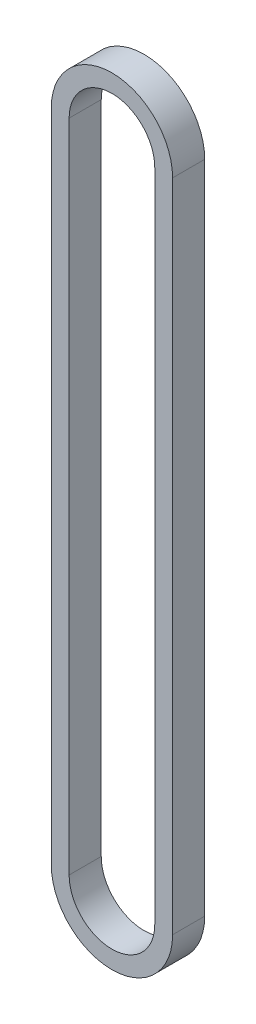
ISO-10303-21;
HEADER;
FILE_DESCRIPTION(('STEP AP214'),'2;1');
FILE_NAME('part.step','',(''),(''),'','','');
FILE_SCHEMA(('AUTOMOTIVE_DESIGN { 1 0 10303 214 1 1 1 1 }'));
ENDSEC;
DATA;
#1=APPLICATION_CONTEXT('core data for automotive mechanical design processes');
#2=APPLICATION_PROTOCOL_DEFINITION('international standard','automotive_design',2000,#1);
#3=PRODUCT_CONTEXT('',#1,'mechanical');
#4=PRODUCT('Part','Part','',(#3));
#5=PRODUCT_RELATED_PRODUCT_CATEGORY('part','',(#4));
#6=PRODUCT_DEFINITION_FORMATION('','',#4);
#7=PRODUCT_DEFINITION_CONTEXT('part definition',#1,'design');
#8=PRODUCT_DEFINITION('design','',#6,#7);
#9=PRODUCT_DEFINITION_SHAPE('','',#8);
#10=(LENGTH_UNIT() NAMED_UNIT(*) SI_UNIT(.MILLI.,.METRE.));
#11=(NAMED_UNIT(*) PLANE_ANGLE_UNIT() SI_UNIT($,.RADIAN.));
#12=(NAMED_UNIT(*) SI_UNIT($,.STERADIAN.) SOLID_ANGLE_UNIT());
#13=UNCERTAINTY_MEASURE_WITH_UNIT(LENGTH_MEASURE(1.E-05),#10,'distance_accuracy_value','');
#14=(GEOMETRIC_REPRESENTATION_CONTEXT(3) GLOBAL_UNCERTAINTY_ASSIGNED_CONTEXT((#13)) GLOBAL_UNIT_ASSIGNED_CONTEXT((#10,
#11,#12)) REPRESENTATION_CONTEXT('',''));
#15=CARTESIAN_POINT('',(0.,0.,0.));
#16=DIRECTION('',(0.,0.,1.));
#17=DIRECTION('',(1.,0.,0.));
#18=AXIS2_PLACEMENT_3D('',#15,#16,#17);
#19=CARTESIAN_POINT('',(0.,-45.925,4.5));
#20=DIRECTION('',(0.,0.,1.));
#21=DIRECTION('',(1.,0.,0.));
#22=AXIS2_PLACEMENT_3D('',#19,#20,#21);
#23=PLANE('',#22);
#24=CARTESIAN_POINT('',(0.,-45.925,4.5));
#25=DIRECTION('',(0.,0.,1.));
#26=DIRECTION('',(1.,0.,0.));
#27=AXIS2_PLACEMENT_3D('',#24,#25,#26);
#28=CIRCLE('',#27,8.5);
#29=CARTESIAN_POINT('',(-8.49999999999999,-45.925,4.5));
#30=VERTEX_POINT('',#29);
#31=CARTESIAN_POINT('',(8.50000000000001,-45.925,4.5));
#32=VERTEX_POINT('',#31);
#33=EDGE_CURVE('E136',#30,#32,#28,.T.);
#34=ORIENTED_EDGE('',*,*,#33,.T.);
#35=DIRECTION('',(0.,1.,0.));
#36=VECTOR('',#35,1.);
#37=CARTESIAN_POINT('',(8.50000000000001,-45.925,4.5));
#38=LINE('',#37,#36);
#39=CARTESIAN_POINT('',(8.49999999999999,45.925,4.5));
#40=VERTEX_POINT('',#39);
#41=EDGE_CURVE('E139',#32,#40,#38,.T.);
#42=ORIENTED_EDGE('',*,*,#41,.T.);
#43=CARTESIAN_POINT('',(0.,45.925,4.5));
#44=DIRECTION('',(0.,0.,1.));
#45=DIRECTION('',(1.,0.,0.));
#46=AXIS2_PLACEMENT_3D('',#43,#44,#45);
#47=CIRCLE('',#46,8.5);
#48=CARTESIAN_POINT('',(-8.5,45.925,4.5));
#49=VERTEX_POINT('',#48);
#50=EDGE_CURVE('E142',#40,#49,#47,.T.);
#51=ORIENTED_EDGE('',*,*,#50,.T.);
#52=DIRECTION('',(0.,-1.,0.));
#53=VECTOR('',#52,1.);
#54=CARTESIAN_POINT('',(-8.49999999999999,-45.925,4.5));
#55=LINE('',#54,#53);
#56=EDGE_CURVE('E144',#49,#30,#55,.T.);
#57=ORIENTED_EDGE('',*,*,#56,.T.);
#58=EDGE_LOOP('',(#34,#42,#51,#57));
#59=FACE_BOUND('',#58,.T.);
#60=DIRECTION('',(0.,1.,0.));
#61=VECTOR('',#60,1.);
#62=CARTESIAN_POINT('',(6.,-45.925,4.5));
#63=LINE('',#62,#61);
#64=CARTESIAN_POINT('',(6.,-45.925,4.5));
#65=VERTEX_POINT('',#64);
#66=CARTESIAN_POINT('',(5.99999999999999,45.925,4.5));
#67=VERTEX_POINT('',#66);
#68=EDGE_CURVE('E108',#65,#67,#63,.T.);
#69=ORIENTED_EDGE('',*,*,#68,.F.);
#70=CARTESIAN_POINT('',(0.,-45.925,4.5));
#71=DIRECTION('',(0.,0.,1.));
#72=DIRECTION('',(1.,0.,0.));
#73=AXIS2_PLACEMENT_3D('',#70,#71,#72);
#74=CIRCLE('',#73,6.);
#75=CARTESIAN_POINT('',(-6.,-45.925,4.5));
#76=VERTEX_POINT('',#75);
#77=EDGE_CURVE('E100',#76,#65,#74,.T.);
#78=ORIENTED_EDGE('',*,*,#77,.F.);
#79=DIRECTION('',(0.,-1.,0.));
#80=VECTOR('',#79,1.);
#81=CARTESIAN_POINT('',(-6.,-45.925,4.5));
#82=LINE('',#81,#80);
#83=CARTESIAN_POINT('',(-6.,45.925,4.5));
#84=VERTEX_POINT('',#83);
#85=EDGE_CURVE('E122',#84,#76,#82,.T.);
#86=ORIENTED_EDGE('',*,*,#85,.F.);
#87=CARTESIAN_POINT('',(0.,45.925,4.5));
#88=DIRECTION('',(0.,0.,1.));
#89=DIRECTION('',(1.,0.,0.));
#90=AXIS2_PLACEMENT_3D('',#87,#88,#89);
#91=CIRCLE('',#90,6.);
#92=EDGE_CURVE('E120',#67,#84,#91,.T.);
#93=ORIENTED_EDGE('',*,*,#92,.F.);
#94=EDGE_LOOP('',(#69,#78,#86,#93));
#95=FACE_BOUND('',#94,.T.);
#96=ADVANCED_FACE('F35',(#59,#95),#23,.T.);
#97=CARTESIAN_POINT('',(0.,-45.925,0.));
#98=DIRECTION('',(0.,0.,1.));
#99=DIRECTION('',(1.,0.,0.));
#100=AXIS2_PLACEMENT_3D('',#97,#98,#99);
#101=PLANE('',#100);
#102=CARTESIAN_POINT('',(0.,-45.925,0.));
#103=DIRECTION('',(0.,0.,1.));
#104=DIRECTION('',(1.,0.,0.));
#105=AXIS2_PLACEMENT_3D('',#102,#103,#104);
#106=CIRCLE('',#105,8.5);
#107=CARTESIAN_POINT('',(-8.49999999999999,-45.925,0.));
#108=VERTEX_POINT('',#107);
#109=CARTESIAN_POINT('',(8.50000000000001,-45.925,0.));
#110=VERTEX_POINT('',#109);
#111=EDGE_CURVE('E116',#108,#110,#106,.T.);
#112=ORIENTED_EDGE('',*,*,#111,.F.);
#113=DIRECTION('',(0.,-1.,0.));
#114=VECTOR('',#113,1.);
#115=CARTESIAN_POINT('',(-8.49999999999999,-45.925,0.));
#116=LINE('',#115,#114);
#117=CARTESIAN_POINT('',(-8.5,45.925,0.));
#118=VERTEX_POINT('',#117);
#119=EDGE_CURVE('E140',#118,#108,#116,.T.);
#120=ORIENTED_EDGE('',*,*,#119,.F.);
#121=CARTESIAN_POINT('',(0.,45.925,0.));
#122=DIRECTION('',(0.,0.,1.));
#123=DIRECTION('',(1.,0.,0.));
#124=AXIS2_PLACEMENT_3D('',#121,#122,#123);
#125=CIRCLE('',#124,8.5);
#126=CARTESIAN_POINT('',(8.49999999999999,45.925,0.));
#127=VERTEX_POINT('',#126);
#128=EDGE_CURVE('E151',#127,#118,#125,.T.);
#129=ORIENTED_EDGE('',*,*,#128,.F.);
#130=DIRECTION('',(0.,1.,0.));
#131=VECTOR('',#130,1.);
#132=CARTESIAN_POINT('',(8.50000000000001,-45.925,0.));
#133=LINE('',#132,#131);
#134=EDGE_CURVE('E149',#110,#127,#133,.T.);
#135=ORIENTED_EDGE('',*,*,#134,.F.);
#136=EDGE_LOOP('',(#112,#120,#129,#135));
#137=FACE_BOUND('',#136,.T.);
#138=CARTESIAN_POINT('',(0.,-45.925,0.));
#139=DIRECTION('',(0.,0.,1.));
#140=DIRECTION('',(1.,0.,0.));
#141=AXIS2_PLACEMENT_3D('',#138,#139,#140);
#142=CIRCLE('',#141,6.);
#143=CARTESIAN_POINT('',(-6.,-45.925,0.));
#144=VERTEX_POINT('',#143);
#145=CARTESIAN_POINT('',(6.,-45.925,0.));
#146=VERTEX_POINT('',#145);
#147=EDGE_CURVE('E58',#144,#146,#142,.T.);
#148=ORIENTED_EDGE('',*,*,#147,.T.);
#149=DIRECTION('',(0.,1.,0.));
#150=VECTOR('',#149,1.);
#151=CARTESIAN_POINT('',(6.,-45.925,0.));
#152=LINE('',#151,#150);
#153=CARTESIAN_POINT('',(5.99999999999999,45.925,0.));
#154=VERTEX_POINT('',#153);
#155=EDGE_CURVE('E115',#146,#154,#152,.T.);
#156=ORIENTED_EDGE('',*,*,#155,.T.);
#157=CARTESIAN_POINT('',(0.,45.925,0.));
#158=DIRECTION('',(0.,0.,1.));
#159=DIRECTION('',(1.,0.,0.));
#160=AXIS2_PLACEMENT_3D('',#157,#158,#159);
#161=CIRCLE('',#160,6.);
#162=CARTESIAN_POINT('',(-6.,45.925,0.));
#163=VERTEX_POINT('',#162);
#164=EDGE_CURVE('E128',#154,#163,#161,.T.);
#165=ORIENTED_EDGE('',*,*,#164,.T.);
#166=DIRECTION('',(0.,-1.,0.));
#167=VECTOR('',#166,1.);
#168=CARTESIAN_POINT('',(-6.,-45.925,0.));
#169=LINE('',#168,#167);
#170=EDGE_CURVE('E109',#163,#144,#169,.T.);
#171=ORIENTED_EDGE('',*,*,#170,.T.);
#172=EDGE_LOOP('',(#148,#156,#165,#171));
#173=FACE_BOUND('',#172,.T.);
#174=ADVANCED_FACE('F169',(#137,#173),#101,.F.);
#175=CARTESIAN_POINT('',(0.,-45.925,4.5));
#176=DIRECTION('',(0.,0.,-1.));
#177=DIRECTION('',(-1.,0.,0.));
#178=AXIS2_PLACEMENT_3D('',#175,#176,#177);
#179=CYLINDRICAL_SURFACE('',#178,8.5);
#180=ORIENTED_EDGE('',*,*,#111,.T.);
#181=DIRECTION('',(0.,0.,-1.));
#182=VECTOR('',#181,1.);
#183=CARTESIAN_POINT('',(8.50000000000001,-45.925,4.5));
#184=LINE('',#183,#182);
#185=EDGE_CURVE('E11',#32,#110,#184,.T.);
#186=ORIENTED_EDGE('',*,*,#185,.F.);
#187=ORIENTED_EDGE('',*,*,#33,.F.);
#188=DIRECTION('',(0.,0.,-1.));
#189=VECTOR('',#188,1.);
#190=CARTESIAN_POINT('',(-8.49999999999999,-45.925,4.5));
#191=LINE('',#190,#189);
#192=EDGE_CURVE('E146',#30,#108,#191,.T.);
#193=ORIENTED_EDGE('',*,*,#192,.T.);
#194=EDGE_LOOP('',(#180,#186,#187,#193));
#195=FACE_BOUND('',#194,.T.);
#196=ADVANCED_FACE('F37',(#195),#179,.T.);
#197=CARTESIAN_POINT('',(8.50000000000001,-45.925,4.5));
#198=DIRECTION('',(-1.,0.,0.));
#199=DIRECTION('',(0.,-1.,0.));
#200=AXIS2_PLACEMENT_3D('',#197,#198,#199);
#201=PLANE('',#200);
#202=ORIENTED_EDGE('',*,*,#134,.T.);
#203=DIRECTION('',(0.,0.,-1.));
#204=VECTOR('',#203,1.);
#205=CARTESIAN_POINT('',(8.49999999999999,45.925,4.5));
#206=LINE('',#205,#204);
#207=EDGE_CURVE('E43',#40,#127,#206,.T.);
#208=ORIENTED_EDGE('',*,*,#207,.F.);
#209=ORIENTED_EDGE('',*,*,#41,.F.);
#210=ORIENTED_EDGE('',*,*,#185,.T.);
#211=EDGE_LOOP('',(#202,#208,#209,#210));
#212=FACE_BOUND('',#211,.T.);
#213=ADVANCED_FACE('F179',(#212),#201,.F.);
#214=CARTESIAN_POINT('',(0.,45.925,4.5));
#215=DIRECTION('',(0.,0.,-1.));
#216=DIRECTION('',(-1.,0.,0.));
#217=AXIS2_PLACEMENT_3D('',#214,#215,#216);
#218=CYLINDRICAL_SURFACE('',#217,8.5);
#219=ORIENTED_EDGE('',*,*,#128,.T.);
#220=DIRECTION('',(0.,0.,-1.));
#221=VECTOR('',#220,1.);
#222=CARTESIAN_POINT('',(-8.5,45.925,4.5));
#223=LINE('',#222,#221);
#224=EDGE_CURVE('E156',#49,#118,#223,.T.);
#225=ORIENTED_EDGE('',*,*,#224,.F.);
#226=ORIENTED_EDGE('',*,*,#50,.F.);
#227=ORIENTED_EDGE('',*,*,#207,.T.);
#228=EDGE_LOOP('',(#219,#225,#226,#227));
#229=FACE_BOUND('',#228,.T.);
#230=ADVANCED_FACE('F163',(#229),#218,.T.);
#231=CARTESIAN_POINT('',(-8.49999999999999,-45.925,4.5));
#232=DIRECTION('',(1.,0.,0.));
#233=DIRECTION('',(0.,1.,0.));
#234=AXIS2_PLACEMENT_3D('',#231,#232,#233);
#235=PLANE('',#234);
#236=ORIENTED_EDGE('',*,*,#119,.T.);
#237=ORIENTED_EDGE('',*,*,#192,.F.);
#238=ORIENTED_EDGE('',*,*,#56,.F.);
#239=ORIENTED_EDGE('',*,*,#224,.T.);
#240=EDGE_LOOP('',(#236,#237,#238,#239));
#241=FACE_BOUND('',#240,.T.);
#242=ADVANCED_FACE('F173',(#241),#235,.F.);
#243=CARTESIAN_POINT('',(0.,-45.925,4.5));
#244=DIRECTION('',(0.,0.,-1.));
#245=DIRECTION('',(-1.,0.,0.));
#246=AXIS2_PLACEMENT_3D('',#243,#244,#245);
#247=CYLINDRICAL_SURFACE('',#246,6.);
#248=ORIENTED_EDGE('',*,*,#147,.F.);
#249=DIRECTION('',(0.,0.,-1.));
#250=VECTOR('',#249,1.);
#251=CARTESIAN_POINT('',(-6.,-45.925,4.5));
#252=LINE('',#251,#250);
#253=EDGE_CURVE('E104',#76,#144,#252,.T.);
#254=ORIENTED_EDGE('',*,*,#253,.F.);
#255=ORIENTED_EDGE('',*,*,#77,.T.);
#256=DIRECTION('',(0.,0.,-1.));
#257=VECTOR('',#256,1.);
#258=CARTESIAN_POINT('',(6.,-45.925,4.5));
#259=LINE('',#258,#257);
#260=EDGE_CURVE('E103',#65,#146,#259,.T.);
#261=ORIENTED_EDGE('',*,*,#260,.T.);
#262=EDGE_LOOP('',(#248,#254,#255,#261));
#263=FACE_BOUND('',#262,.T.);
#264=ADVANCED_FACE('F102',(#263),#247,.F.);
#265=CARTESIAN_POINT('',(6.,-45.925,4.5));
#266=DIRECTION('',(-1.,0.,0.));
#267=DIRECTION('',(0.,0.,1.));
#268=AXIS2_PLACEMENT_3D('',#265,#266,#267);
#269=PLANE('',#268);
#270=ORIENTED_EDGE('',*,*,#155,.F.);
#271=ORIENTED_EDGE('',*,*,#260,.F.);
#272=ORIENTED_EDGE('',*,*,#68,.T.);
#273=DIRECTION('',(0.,0.,-1.));
#274=VECTOR('',#273,1.);
#275=CARTESIAN_POINT('',(5.99999999999999,45.925,4.5));
#276=LINE('',#275,#274);
#277=EDGE_CURVE('E117',#67,#154,#276,.T.);
#278=ORIENTED_EDGE('',*,*,#277,.T.);
#279=EDGE_LOOP('',(#270,#271,#272,#278));
#280=FACE_BOUND('',#279,.T.);
#281=ADVANCED_FACE('F112',(#280),#269,.T.);
#282=CARTESIAN_POINT('',(0.,45.925,4.5));
#283=DIRECTION('',(0.,0.,-1.));
#284=DIRECTION('',(-1.,0.,0.));
#285=AXIS2_PLACEMENT_3D('',#282,#283,#284);
#286=CYLINDRICAL_SURFACE('',#285,6.);
#287=ORIENTED_EDGE('',*,*,#164,.F.);
#288=ORIENTED_EDGE('',*,*,#277,.F.);
#289=ORIENTED_EDGE('',*,*,#92,.T.);
#290=DIRECTION('',(0.,0.,-1.));
#291=VECTOR('',#290,1.);
#292=CARTESIAN_POINT('',(-6.,45.925,4.5));
#293=LINE('',#292,#291);
#294=EDGE_CURVE('E50',#84,#163,#293,.T.);
#295=ORIENTED_EDGE('',*,*,#294,.T.);
#296=EDGE_LOOP('',(#287,#288,#289,#295));
#297=FACE_BOUND('',#296,.T.);
#298=ADVANCED_FACE('F202',(#297),#286,.F.);
#299=CARTESIAN_POINT('',(-6.,-45.925,4.5));
#300=DIRECTION('',(1.,0.,0.));
#301=DIRECTION('',(0.,0.,-1.));
#302=AXIS2_PLACEMENT_3D('',#299,#300,#301);
#303=PLANE('',#302);
#304=ORIENTED_EDGE('',*,*,#170,.F.);
#305=ORIENTED_EDGE('',*,*,#294,.F.);
#306=ORIENTED_EDGE('',*,*,#85,.T.);
#307=ORIENTED_EDGE('',*,*,#253,.T.);
#308=EDGE_LOOP('',(#304,#305,#306,#307));
#309=FACE_BOUND('',#308,.T.);
#310=ADVANCED_FACE('F206',(#309),#303,.T.);
#311=CLOSED_SHELL('',(#96,#174,#196,#213,#230,#242,#264,#281,#298,#310));
#312=MANIFOLD_SOLID_BREP('B2',#311);
#313=ADVANCED_BREP_SHAPE_REPRESENTATION('',(#18,#312),#14);
#314=SHAPE_DEFINITION_REPRESENTATION(#9,#313);
ENDSEC;
END-ISO-10303-21;
